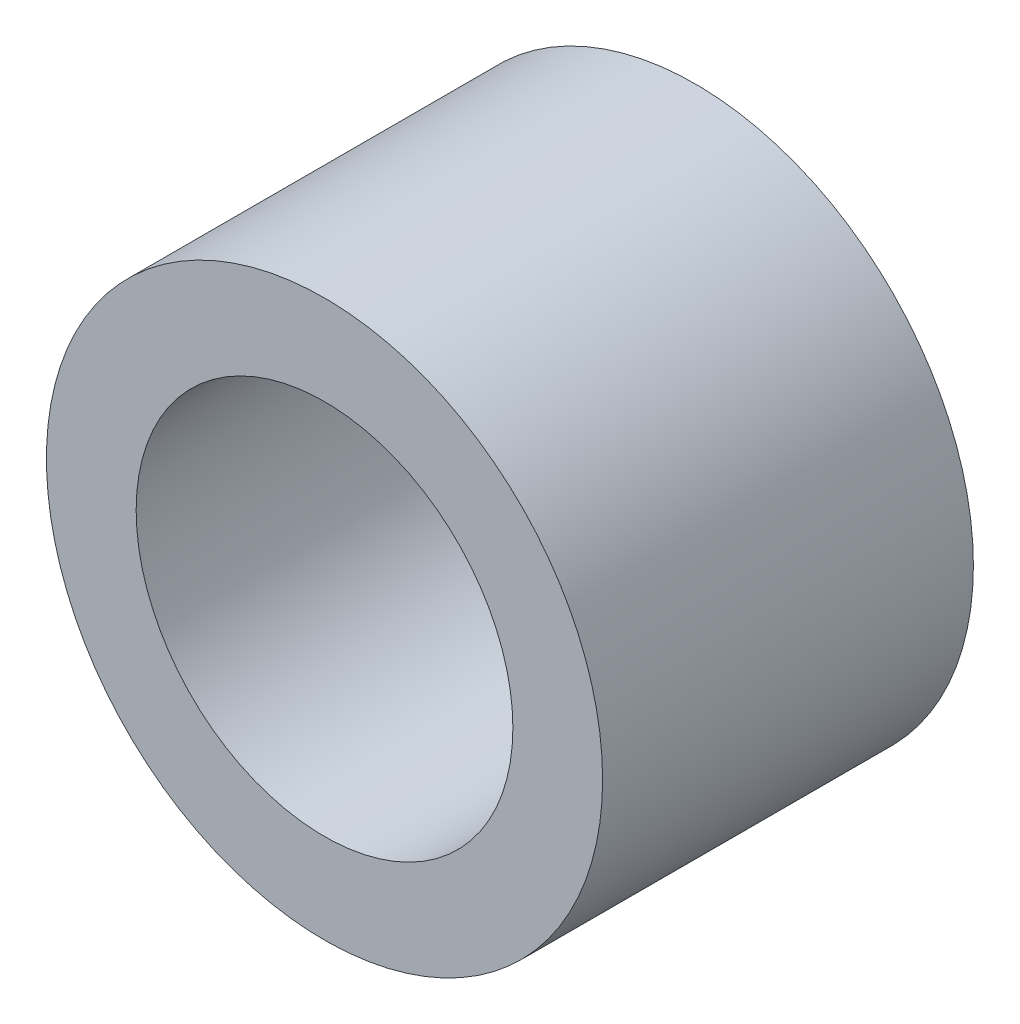
ISO-10303-21;
HEADER;
FILE_DESCRIPTION(('STEP AP214'),'2;1');
FILE_NAME('part.step','',(''),(''),'','','');
FILE_SCHEMA(('AUTOMOTIVE_DESIGN { 1 0 10303 214 1 1 1 1 }'));
ENDSEC;
DATA;
#1=APPLICATION_CONTEXT('core data for automotive mechanical design processes');
#2=APPLICATION_PROTOCOL_DEFINITION('international standard','automotive_design',2000,#1);
#3=PRODUCT_CONTEXT('',#1,'mechanical');
#4=PRODUCT('Part','Part','',(#3));
#5=PRODUCT_RELATED_PRODUCT_CATEGORY('part','',(#4));
#6=PRODUCT_DEFINITION_FORMATION('','',#4);
#7=PRODUCT_DEFINITION_CONTEXT('part definition',#1,'design');
#8=PRODUCT_DEFINITION('design','',#6,#7);
#9=PRODUCT_DEFINITION_SHAPE('','',#8);
#10=(LENGTH_UNIT() NAMED_UNIT(*) SI_UNIT(.MILLI.,.METRE.));
#11=(NAMED_UNIT(*) PLANE_ANGLE_UNIT() SI_UNIT($,.RADIAN.));
#12=(NAMED_UNIT(*) SI_UNIT($,.STERADIAN.) SOLID_ANGLE_UNIT());
#13=UNCERTAINTY_MEASURE_WITH_UNIT(LENGTH_MEASURE(1.E-05),#10,'distance_accuracy_value','');
#14=(GEOMETRIC_REPRESENTATION_CONTEXT(3) GLOBAL_UNCERTAINTY_ASSIGNED_CONTEXT((#13)) GLOBAL_UNIT_ASSIGNED_CONTEXT((#10,
#11,#12)) REPRESENTATION_CONTEXT('',''));
#15=CARTESIAN_POINT('',(0.,0.,0.));
#16=DIRECTION('',(0.,0.,1.));
#17=DIRECTION('',(1.,0.,0.));
#18=AXIS2_PLACEMENT_3D('',#15,#16,#17);
#19=CARTESIAN_POINT('',(0.,0.,3.175));
#20=DIRECTION('',(0.,0.,1.));
#21=DIRECTION('',(1.,0.,0.));
#22=AXIS2_PLACEMENT_3D('',#19,#20,#21);
#23=PLANE('',#22);
#24=CARTESIAN_POINT('',(0.,0.,3.175));
#25=DIRECTION('',(0.,0.,1.));
#26=DIRECTION('',(1.,0.,0.));
#27=AXIS2_PLACEMENT_3D('',#24,#25,#26);
#28=CIRCLE('',#27,4.7625);
#29=CARTESIAN_POINT('',(4.7625,0.,3.175));
#30=VERTEX_POINT('',#29);
#31=EDGE_CURVE('E10',#30,#30,#28,.T.);
#32=ORIENTED_EDGE('',*,*,#31,.T.);
#33=EDGE_LOOP('',(#32));
#34=FACE_BOUND('',#33,.T.);
#35=CARTESIAN_POINT('',(0.,0.,3.175));
#36=DIRECTION('',(0.,0.,1.));
#37=DIRECTION('',(1.,0.,0.));
#38=AXIS2_PLACEMENT_3D('',#35,#36,#37);
#39=CIRCLE('',#38,3.2258);
#40=CARTESIAN_POINT('',(3.2258,0.,3.175));
#41=VERTEX_POINT('',#40);
#42=EDGE_CURVE('E44',#41,#41,#39,.T.);
#43=ORIENTED_EDGE('',*,*,#42,.F.);
#44=EDGE_LOOP('',(#43));
#45=FACE_BOUND('',#44,.T.);
#46=ADVANCED_FACE('F33',(#34,#45),#23,.T.);
#47=CARTESIAN_POINT('',(0.,0.,-3.175));
#48=DIRECTION('',(0.,0.,1.));
#49=DIRECTION('',(1.,0.,0.));
#50=AXIS2_PLACEMENT_3D('',#47,#48,#49);
#51=PLANE('',#50);
#52=CARTESIAN_POINT('',(0.,0.,-3.175));
#53=DIRECTION('',(0.,0.,1.));
#54=DIRECTION('',(1.,0.,0.));
#55=AXIS2_PLACEMENT_3D('',#52,#53,#54);
#56=CIRCLE('',#55,4.7625);
#57=CARTESIAN_POINT('',(4.7625,0.,-3.175));
#58=VERTEX_POINT('',#57);
#59=EDGE_CURVE('E37',#58,#58,#56,.T.);
#60=ORIENTED_EDGE('',*,*,#59,.F.);
#61=EDGE_LOOP('',(#60));
#62=FACE_BOUND('',#61,.T.);
#63=CARTESIAN_POINT('',(0.,0.,-3.175));
#64=DIRECTION('',(0.,0.,1.));
#65=DIRECTION('',(1.,0.,0.));
#66=AXIS2_PLACEMENT_3D('',#63,#64,#65);
#67=CIRCLE('',#66,3.2258);
#68=CARTESIAN_POINT('',(3.2258,0.,-3.175));
#69=VERTEX_POINT('',#68);
#70=EDGE_CURVE('E46',#69,#69,#67,.T.);
#71=ORIENTED_EDGE('',*,*,#70,.T.);
#72=EDGE_LOOP('',(#71));
#73=FACE_BOUND('',#72,.T.);
#74=ADVANCED_FACE('F56',(#62,#73),#51,.F.);
#75=CARTESIAN_POINT('',(0.,0.,3.175));
#76=DIRECTION('',(0.,0.,-1.));
#77=DIRECTION('',(-1.,0.,0.));
#78=AXIS2_PLACEMENT_3D('',#75,#76,#77);
#79=CYLINDRICAL_SURFACE('',#78,4.7625);
#80=ORIENTED_EDGE('',*,*,#31,.F.);
#81=EDGE_LOOP('',(#80));
#82=FACE_BOUND('',#81,.T.);
#83=ORIENTED_EDGE('',*,*,#59,.T.);
#84=EDGE_LOOP('',(#83));
#85=FACE_BOUND('',#84,.T.);
#86=ADVANCED_FACE('F35',(#82,#85),#79,.T.);
#87=CARTESIAN_POINT('',(0.,0.,3.175));
#88=DIRECTION('',(0.,0.,-1.));
#89=DIRECTION('',(-1.,0.,0.));
#90=AXIS2_PLACEMENT_3D('',#87,#88,#89);
#91=CYLINDRICAL_SURFACE('',#90,3.2258);
#92=ORIENTED_EDGE('',*,*,#42,.T.);
#93=EDGE_LOOP('',(#92));
#94=FACE_BOUND('',#93,.T.);
#95=ORIENTED_EDGE('',*,*,#70,.F.);
#96=EDGE_LOOP('',(#95));
#97=FACE_BOUND('',#96,.T.);
#98=ADVANCED_FACE('F52',(#94,#97),#91,.F.);
#99=CLOSED_SHELL('',(#46,#74,#86,#98));
#100=MANIFOLD_SOLID_BREP('B2',#99);
#101=ADVANCED_BREP_SHAPE_REPRESENTATION('',(#18,#100),#14);
#102=SHAPE_DEFINITION_REPRESENTATION(#9,#101);
ENDSEC;
END-ISO-10303-21;
